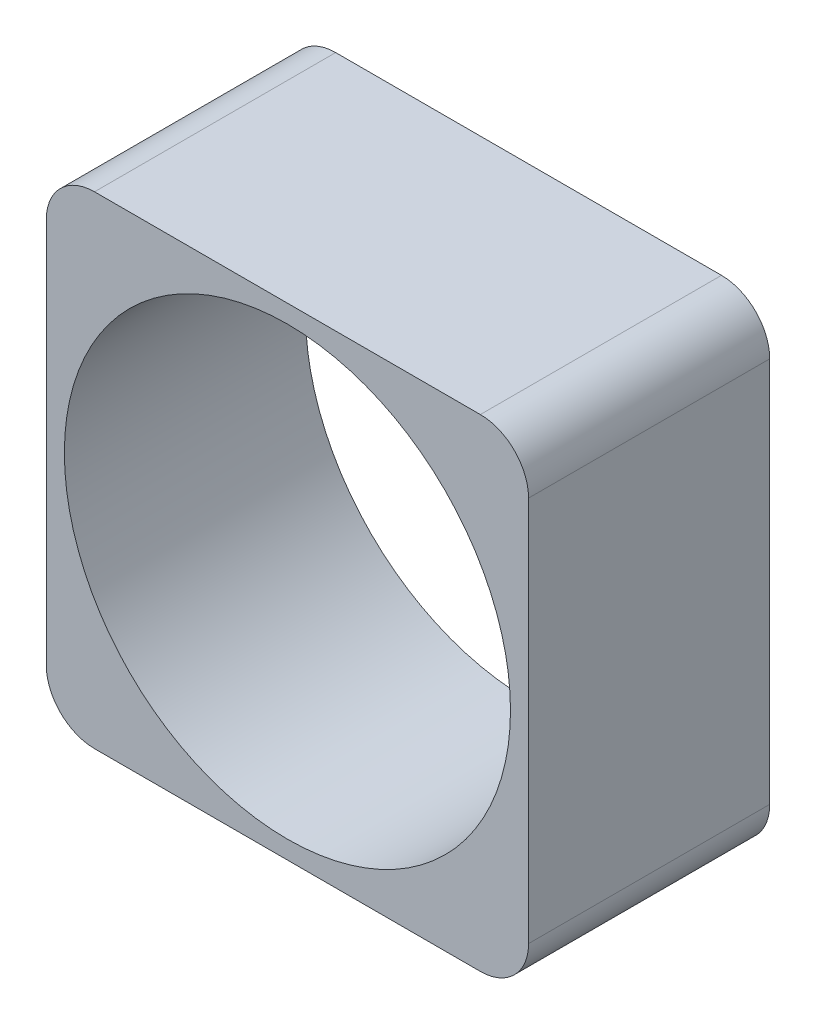
ISO-10303-21;
HEADER;
FILE_DESCRIPTION(('STEP AP214'),'2;1');
FILE_NAME('part.step','',(''),(''),'','','');
FILE_SCHEMA(('AUTOMOTIVE_DESIGN { 1 0 10303 214 1 1 1 1 }'));
ENDSEC;
DATA;
#1=APPLICATION_CONTEXT('core data for automotive mechanical design processes');
#2=APPLICATION_PROTOCOL_DEFINITION('international standard','automotive_design',2000,#1);
#3=PRODUCT_CONTEXT('',#1,'mechanical');
#4=PRODUCT('Part','Part','',(#3));
#5=PRODUCT_RELATED_PRODUCT_CATEGORY('part','',(#4));
#6=PRODUCT_DEFINITION_FORMATION('','',#4);
#7=PRODUCT_DEFINITION_CONTEXT('part definition',#1,'design');
#8=PRODUCT_DEFINITION('design','',#6,#7);
#9=PRODUCT_DEFINITION_SHAPE('','',#8);
#10=(LENGTH_UNIT() NAMED_UNIT(*) SI_UNIT(.MILLI.,.METRE.));
#11=(NAMED_UNIT(*) PLANE_ANGLE_UNIT() SI_UNIT($,.RADIAN.));
#12=(NAMED_UNIT(*) SI_UNIT($,.STERADIAN.) SOLID_ANGLE_UNIT());
#13=UNCERTAINTY_MEASURE_WITH_UNIT(LENGTH_MEASURE(1.E-05),#10,'distance_accuracy_value','');
#14=(GEOMETRIC_REPRESENTATION_CONTEXT(3) GLOBAL_UNCERTAINTY_ASSIGNED_CONTEXT((#13)) GLOBAL_UNIT_ASSIGNED_CONTEXT((#10,
#11,#12)) REPRESENTATION_CONTEXT('',''));
#15=CARTESIAN_POINT('',(0.,0.,0.));
#16=DIRECTION('',(0.,0.,1.));
#17=DIRECTION('',(1.,0.,0.));
#18=AXIS2_PLACEMENT_3D('',#15,#16,#17);
#19=CARTESIAN_POINT('',(-16.,-16.,20.));
#20=DIRECTION('',(0.,0.,-1.));
#21=DIRECTION('',(-1.,0.,0.));
#22=AXIS2_PLACEMENT_3D('',#19,#20,#21);
#23=CYLINDRICAL_SURFACE('',#22,4.);
#24=CARTESIAN_POINT('',(-16.,-16.,0.));
#25=DIRECTION('',(0.,0.,1.));
#26=DIRECTION('',(1.,0.,0.));
#27=AXIS2_PLACEMENT_3D('',#24,#25,#26);
#28=CIRCLE('',#27,4.);
#29=CARTESIAN_POINT('',(-20.,-16.,0.));
#30=VERTEX_POINT('',#29);
#31=CARTESIAN_POINT('',(-16.,-20.,0.));
#32=VERTEX_POINT('',#31);
#33=EDGE_CURVE('E197',#30,#32,#28,.T.);
#34=ORIENTED_EDGE('',*,*,#33,.T.);
#35=DIRECTION('',(0.,0.,-1.));
#36=VECTOR('',#35,1.);
#37=CARTESIAN_POINT('',(-16.,-20.,20.));
#38=LINE('',#37,#36);
#39=CARTESIAN_POINT('',(-16.,-20.,20.));
#40=VERTEX_POINT('',#39);
#41=EDGE_CURVE('E12',#40,#32,#38,.T.);
#42=ORIENTED_EDGE('',*,*,#41,.F.);
#43=CARTESIAN_POINT('',(-16.,-16.,20.));
#44=DIRECTION('',(0.,0.,1.));
#45=DIRECTION('',(1.,0.,0.));
#46=AXIS2_PLACEMENT_3D('',#43,#44,#45);
#47=CIRCLE('',#46,4.);
#48=CARTESIAN_POINT('',(-20.,-16.,20.));
#49=VERTEX_POINT('',#48);
#50=EDGE_CURVE('E178',#49,#40,#47,.T.);
#51=ORIENTED_EDGE('',*,*,#50,.F.);
#52=DIRECTION('',(0.,0.,-1.));
#53=VECTOR('',#52,1.);
#54=CARTESIAN_POINT('',(-20.,-16.,20.));
#55=LINE('',#54,#53);
#56=EDGE_CURVE('E160',#49,#30,#55,.T.);
#57=ORIENTED_EDGE('',*,*,#56,.T.);
#58=EDGE_LOOP('',(#34,#42,#51,#57));
#59=FACE_BOUND('',#58,.T.);
#60=ADVANCED_FACE('F45',(#59),#23,.T.);
#61=CARTESIAN_POINT('',(16.,-20.,20.));
#62=DIRECTION('',(0.,1.,0.));
#63=DIRECTION('',(-1.,0.,0.));
#64=AXIS2_PLACEMENT_3D('',#61,#62,#63);
#65=PLANE('',#64);
#66=DIRECTION('',(1.,0.,0.));
#67=VECTOR('',#66,1.);
#68=CARTESIAN_POINT('',(16.,-20.,0.));
#69=LINE('',#68,#67);
#70=CARTESIAN_POINT('',(16.,-20.,0.));
#71=VERTEX_POINT('',#70);
#72=EDGE_CURVE('E192',#32,#71,#69,.T.);
#73=ORIENTED_EDGE('',*,*,#72,.T.);
#74=DIRECTION('',(0.,0.,-1.));
#75=VECTOR('',#74,1.);
#76=CARTESIAN_POINT('',(16.,-20.,20.));
#77=LINE('',#76,#75);
#78=CARTESIAN_POINT('',(16.,-20.,20.));
#79=VERTEX_POINT('',#78);
#80=EDGE_CURVE('E56',#79,#71,#77,.T.);
#81=ORIENTED_EDGE('',*,*,#80,.F.);
#82=DIRECTION('',(1.,0.,0.));
#83=VECTOR('',#82,1.);
#84=CARTESIAN_POINT('',(16.,-20.,20.));
#85=LINE('',#84,#83);
#86=EDGE_CURVE('E119',#40,#79,#85,.T.);
#87=ORIENTED_EDGE('',*,*,#86,.F.);
#88=ORIENTED_EDGE('',*,*,#41,.T.);
#89=EDGE_LOOP('',(#73,#81,#87,#88));
#90=FACE_BOUND('',#89,.T.);
#91=ADVANCED_FACE('F302',(#90),#65,.F.);
#92=CARTESIAN_POINT('',(16.,-16.,20.));
#93=DIRECTION('',(0.,0.,-1.));
#94=DIRECTION('',(-1.,0.,0.));
#95=AXIS2_PLACEMENT_3D('',#92,#93,#94);
#96=CYLINDRICAL_SURFACE('',#95,4.);
#97=CARTESIAN_POINT('',(16.,-16.,0.));
#98=DIRECTION('',(0.,0.,1.));
#99=DIRECTION('',(1.,0.,0.));
#100=AXIS2_PLACEMENT_3D('',#97,#98,#99);
#101=CIRCLE('',#100,4.);
#102=CARTESIAN_POINT('',(20.,-16.,0.));
#103=VERTEX_POINT('',#102);
#104=EDGE_CURVE('E196',#71,#103,#101,.T.);
#105=ORIENTED_EDGE('',*,*,#104,.T.);
#106=DIRECTION('',(0.,0.,-1.));
#107=VECTOR('',#106,1.);
#108=CARTESIAN_POINT('',(20.,-16.,20.));
#109=LINE('',#108,#107);
#110=CARTESIAN_POINT('',(20.,-16.,20.));
#111=VERTEX_POINT('',#110);
#112=EDGE_CURVE('E212',#111,#103,#109,.T.);
#113=ORIENTED_EDGE('',*,*,#112,.F.);
#114=CARTESIAN_POINT('',(16.,-16.,20.));
#115=DIRECTION('',(0.,0.,1.));
#116=DIRECTION('',(1.,0.,0.));
#117=AXIS2_PLACEMENT_3D('',#114,#115,#116);
#118=CIRCLE('',#117,4.);
#119=EDGE_CURVE('E229',#79,#111,#118,.T.);
#120=ORIENTED_EDGE('',*,*,#119,.F.);
#121=ORIENTED_EDGE('',*,*,#80,.T.);
#122=EDGE_LOOP('',(#105,#113,#120,#121));
#123=FACE_BOUND('',#122,.T.);
#124=ADVANCED_FACE('F227',(#123),#96,.T.);
#125=CARTESIAN_POINT('',(20.,-16.,20.));
#126=DIRECTION('',(-1.,0.,0.));
#127=DIRECTION('',(0.,0.,1.));
#128=AXIS2_PLACEMENT_3D('',#125,#126,#127);
#129=PLANE('',#128);
#130=DIRECTION('',(0.,1.,0.));
#131=VECTOR('',#130,1.);
#132=CARTESIAN_POINT('',(20.,-16.,0.));
#133=LINE('',#132,#131);
#134=CARTESIAN_POINT('',(20.,16.,0.));
#135=VERTEX_POINT('',#134);
#136=EDGE_CURVE('E202',#103,#135,#133,.T.);
#137=ORIENTED_EDGE('',*,*,#136,.T.);
#138=DIRECTION('',(0.,0.,-1.));
#139=VECTOR('',#138,1.);
#140=CARTESIAN_POINT('',(20.,16.,20.));
#141=LINE('',#140,#139);
#142=CARTESIAN_POINT('',(20.,16.,20.));
#143=VERTEX_POINT('',#142);
#144=EDGE_CURVE('E217',#143,#135,#141,.T.);
#145=ORIENTED_EDGE('',*,*,#144,.F.);
#146=DIRECTION('',(0.,1.,0.));
#147=VECTOR('',#146,1.);
#148=CARTESIAN_POINT('',(20.,-16.,20.));
#149=LINE('',#148,#147);
#150=EDGE_CURVE('E261',#111,#143,#149,.T.);
#151=ORIENTED_EDGE('',*,*,#150,.F.);
#152=ORIENTED_EDGE('',*,*,#112,.T.);
#153=EDGE_LOOP('',(#137,#145,#151,#152));
#154=FACE_BOUND('',#153,.T.);
#155=ADVANCED_FACE('F260',(#154),#129,.F.);
#156=CARTESIAN_POINT('',(16.,16.,20.));
#157=DIRECTION('',(0.,0.,-1.));
#158=DIRECTION('',(-1.,0.,0.));
#159=AXIS2_PLACEMENT_3D('',#156,#157,#158);
#160=CYLINDRICAL_SURFACE('',#159,4.);
#161=CARTESIAN_POINT('',(16.,16.,0.));
#162=DIRECTION('',(0.,0.,1.));
#163=DIRECTION('',(1.,0.,0.));
#164=AXIS2_PLACEMENT_3D('',#161,#162,#163);
#165=CIRCLE('',#164,4.);
#166=CARTESIAN_POINT('',(16.,20.,0.));
#167=VERTEX_POINT('',#166);
#168=EDGE_CURVE('E235',#135,#167,#165,.T.);
#169=ORIENTED_EDGE('',*,*,#168,.T.);
#170=DIRECTION('',(0.,0.,-1.));
#171=VECTOR('',#170,1.);
#172=CARTESIAN_POINT('',(16.,20.,20.));
#173=LINE('',#172,#171);
#174=CARTESIAN_POINT('',(16.,20.,20.));
#175=VERTEX_POINT('',#174);
#176=EDGE_CURVE('E153',#175,#167,#173,.T.);
#177=ORIENTED_EDGE('',*,*,#176,.F.);
#178=CARTESIAN_POINT('',(16.,16.,20.));
#179=DIRECTION('',(0.,0.,1.));
#180=DIRECTION('',(1.,0.,0.));
#181=AXIS2_PLACEMENT_3D('',#178,#179,#180);
#182=CIRCLE('',#181,4.);
#183=EDGE_CURVE('E142',#143,#175,#182,.T.);
#184=ORIENTED_EDGE('',*,*,#183,.F.);
#185=ORIENTED_EDGE('',*,*,#144,.T.);
#186=EDGE_LOOP('',(#169,#177,#184,#185));
#187=FACE_BOUND('',#186,.T.);
#188=ADVANCED_FACE('F258',(#187),#160,.T.);
#189=CARTESIAN_POINT('',(16.,20.,20.));
#190=DIRECTION('',(0.,-1.,0.));
#191=DIRECTION('',(1.,0.,0.));
#192=AXIS2_PLACEMENT_3D('',#189,#190,#191);
#193=PLANE('',#192);
#194=DIRECTION('',(-1.,0.,0.));
#195=VECTOR('',#194,1.);
#196=CARTESIAN_POINT('',(16.,20.,0.));
#197=LINE('',#196,#195);
#198=CARTESIAN_POINT('',(-16.,20.,0.));
#199=VERTEX_POINT('',#198);
#200=EDGE_CURVE('E151',#167,#199,#197,.T.);
#201=ORIENTED_EDGE('',*,*,#200,.T.);
#202=DIRECTION('',(0.,0.,-1.));
#203=VECTOR('',#202,1.);
#204=CARTESIAN_POINT('',(-16.,20.,20.));
#205=LINE('',#204,#203);
#206=CARTESIAN_POINT('',(-16.,20.,20.));
#207=VERTEX_POINT('',#206);
#208=EDGE_CURVE('E148',#207,#199,#205,.T.);
#209=ORIENTED_EDGE('',*,*,#208,.F.);
#210=DIRECTION('',(-1.,0.,0.));
#211=VECTOR('',#210,1.);
#212=CARTESIAN_POINT('',(16.,20.,20.));
#213=LINE('',#212,#211);
#214=EDGE_CURVE('E136',#175,#207,#213,.T.);
#215=ORIENTED_EDGE('',*,*,#214,.F.);
#216=ORIENTED_EDGE('',*,*,#176,.T.);
#217=EDGE_LOOP('',(#201,#209,#215,#216));
#218=FACE_BOUND('',#217,.T.);
#219=ADVANCED_FACE('F149',(#218),#193,.F.);
#220=CARTESIAN_POINT('',(-16.,16.,20.));
#221=DIRECTION('',(0.,0.,-1.));
#222=DIRECTION('',(-1.,0.,0.));
#223=AXIS2_PLACEMENT_3D('',#220,#221,#222);
#224=CYLINDRICAL_SURFACE('',#223,4.);
#225=CARTESIAN_POINT('',(-16.,16.,0.));
#226=DIRECTION('',(0.,0.,1.));
#227=DIRECTION('',(1.,0.,0.));
#228=AXIS2_PLACEMENT_3D('',#225,#226,#227);
#229=CIRCLE('',#228,4.);
#230=CARTESIAN_POINT('',(-20.,16.,0.));
#231=VERTEX_POINT('',#230);
#232=EDGE_CURVE('E104',#199,#231,#229,.T.);
#233=ORIENTED_EDGE('',*,*,#232,.T.);
#234=DIRECTION('',(0.,0.,-1.));
#235=VECTOR('',#234,1.);
#236=CARTESIAN_POINT('',(-20.,16.,20.));
#237=LINE('',#236,#235);
#238=CARTESIAN_POINT('',(-20.,16.,20.));
#239=VERTEX_POINT('',#238);
#240=EDGE_CURVE('E154',#239,#231,#237,.T.);
#241=ORIENTED_EDGE('',*,*,#240,.F.);
#242=CARTESIAN_POINT('',(-16.,16.,20.));
#243=DIRECTION('',(0.,0.,1.));
#244=DIRECTION('',(1.,0.,0.));
#245=AXIS2_PLACEMENT_3D('',#242,#243,#244);
#246=CIRCLE('',#245,4.);
#247=EDGE_CURVE('E140',#207,#239,#246,.T.);
#248=ORIENTED_EDGE('',*,*,#247,.F.);
#249=ORIENTED_EDGE('',*,*,#208,.T.);
#250=EDGE_LOOP('',(#233,#241,#248,#249));
#251=FACE_BOUND('',#250,.T.);
#252=ADVANCED_FACE('F156',(#251),#224,.T.);
#253=CARTESIAN_POINT('',(-20.,-16.,20.));
#254=DIRECTION('',(1.,0.,0.));
#255=DIRECTION('',(0.,0.,-1.));
#256=AXIS2_PLACEMENT_3D('',#253,#254,#255);
#257=PLANE('',#256);
#258=DIRECTION('',(0.,-1.,0.));
#259=VECTOR('',#258,1.);
#260=CARTESIAN_POINT('',(-20.,-16.,0.));
#261=LINE('',#260,#259);
#262=EDGE_CURVE('E111',#231,#30,#261,.T.);
#263=ORIENTED_EDGE('',*,*,#262,.T.);
#264=ORIENTED_EDGE('',*,*,#56,.F.);
#265=DIRECTION('',(0.,-1.,0.));
#266=VECTOR('',#265,1.);
#267=CARTESIAN_POINT('',(-20.,-16.,20.));
#268=LINE('',#267,#266);
#269=EDGE_CURVE('E67',#239,#49,#268,.T.);
#270=ORIENTED_EDGE('',*,*,#269,.F.);
#271=ORIENTED_EDGE('',*,*,#240,.T.);
#272=EDGE_LOOP('',(#263,#264,#270,#271));
#273=FACE_BOUND('',#272,.T.);
#274=ADVANCED_FACE('F288',(#273),#257,.F.);
#275=CARTESIAN_POINT('',(-16.,-16.,20.));
#276=DIRECTION('',(0.,0.,1.));
#277=DIRECTION('',(1.,0.,0.));
#278=AXIS2_PLACEMENT_3D('',#275,#276,#277);
#279=PLANE('',#278);
#280=CARTESIAN_POINT('',(0.,0.,20.));
#281=DIRECTION('',(0.,0.,1.));
#282=DIRECTION('',(1.,0.,0.));
#283=AXIS2_PLACEMENT_3D('',#280,#281,#282);
#284=CIRCLE('',#283,18.5);
#285=CARTESIAN_POINT('',(18.5,0.,20.));
#286=VERTEX_POINT('',#285);
#287=EDGE_CURVE('E272',#286,#286,#284,.T.);
#288=ORIENTED_EDGE('',*,*,#287,.F.);
#289=EDGE_LOOP('',(#288));
#290=FACE_BOUND('',#289,.T.);
#291=ORIENTED_EDGE('',*,*,#50,.T.);
#292=ORIENTED_EDGE('',*,*,#86,.T.);
#293=ORIENTED_EDGE('',*,*,#119,.T.);
#294=ORIENTED_EDGE('',*,*,#150,.T.);
#295=ORIENTED_EDGE('',*,*,#183,.T.);
#296=ORIENTED_EDGE('',*,*,#214,.T.);
#297=ORIENTED_EDGE('',*,*,#247,.T.);
#298=ORIENTED_EDGE('',*,*,#269,.T.);
#299=EDGE_LOOP('',(#291,#292,#293,#294,#295,#296,#297,#298));
#300=FACE_BOUND('',#299,.T.);
#301=ADVANCED_FACE('F138',(#290,#300),#279,.T.);
#302=CARTESIAN_POINT('',(-16.,-16.,0.));
#303=DIRECTION('',(0.,0.,1.));
#304=DIRECTION('',(1.,0.,0.));
#305=AXIS2_PLACEMENT_3D('',#302,#303,#304);
#306=PLANE('',#305);
#307=CARTESIAN_POINT('',(0.,0.,0.));
#308=DIRECTION('',(0.,0.,1.));
#309=DIRECTION('',(1.,0.,0.));
#310=AXIS2_PLACEMENT_3D('',#307,#308,#309);
#311=CIRCLE('',#310,18.5);
#312=CARTESIAN_POINT('',(18.5,0.,0.));
#313=VERTEX_POINT('',#312);
#314=EDGE_CURVE('E276',#313,#313,#311,.T.);
#315=ORIENTED_EDGE('',*,*,#314,.T.);
#316=EDGE_LOOP('',(#315));
#317=FACE_BOUND('',#316,.T.);
#318=ORIENTED_EDGE('',*,*,#33,.F.);
#319=ORIENTED_EDGE('',*,*,#262,.F.);
#320=ORIENTED_EDGE('',*,*,#232,.F.);
#321=ORIENTED_EDGE('',*,*,#200,.F.);
#322=ORIENTED_EDGE('',*,*,#168,.F.);
#323=ORIENTED_EDGE('',*,*,#136,.F.);
#324=ORIENTED_EDGE('',*,*,#104,.F.);
#325=ORIENTED_EDGE('',*,*,#72,.F.);
#326=EDGE_LOOP('',(#318,#319,#320,#321,#322,#323,#324,#325));
#327=FACE_BOUND('',#326,.T.);
#328=ADVANCED_FACE('F233',(#317,#327),#306,.F.);
#329=CARTESIAN_POINT('',(0.,0.,0.));
#330=DIRECTION('',(0.,0.,1.));
#331=DIRECTION('',(1.,0.,0.));
#332=AXIS2_PLACEMENT_3D('',#329,#330,#331);
#333=CYLINDRICAL_SURFACE('',#332,18.5);
#334=ORIENTED_EDGE('',*,*,#314,.F.);
#335=EDGE_LOOP('',(#334));
#336=FACE_BOUND('',#335,.T.);
#337=ORIENTED_EDGE('',*,*,#287,.T.);
#338=EDGE_LOOP('',(#337));
#339=FACE_BOUND('',#338,.T.);
#340=ADVANCED_FACE('F326',(#336,#339),#333,.F.);
#341=CLOSED_SHELL('',(#60,#91,#124,#155,#188,#219,#252,#274,#301,#328,#340));
#342=MANIFOLD_SOLID_BREP('B2',#341);
#343=ADVANCED_BREP_SHAPE_REPRESENTATION('',(#18,#342),#14);
#344=SHAPE_DEFINITION_REPRESENTATION(#9,#343);
ENDSEC;
END-ISO-10303-21;
